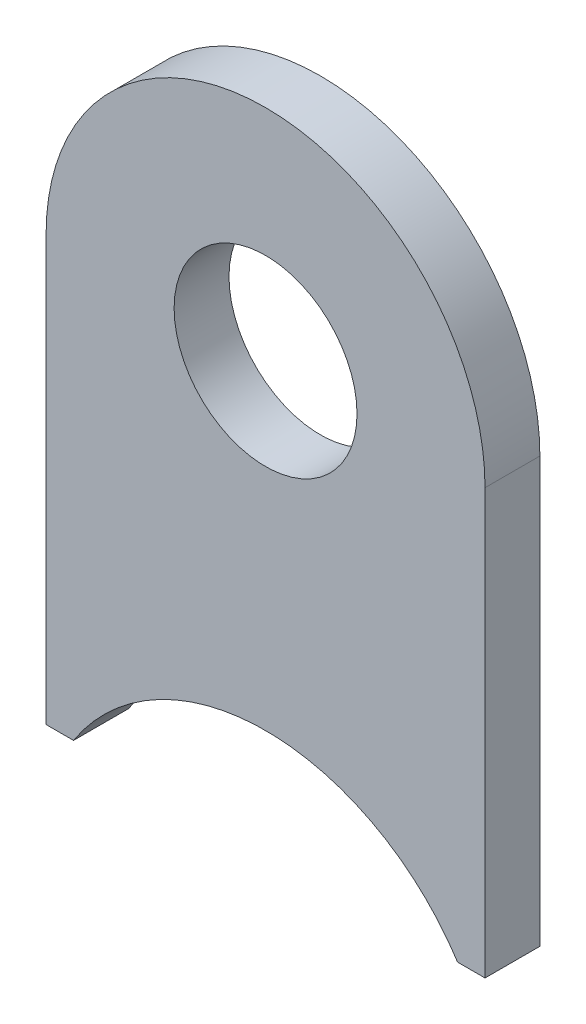
ISO-10303-21;
HEADER;
FILE_DESCRIPTION(('STEP AP214'),'2;1');
FILE_NAME('part.step','',(''),(''),'','','');
FILE_SCHEMA(('AUTOMOTIVE_DESIGN { 1 0 10303 214 1 1 1 1 }'));
ENDSEC;
DATA;
#1=APPLICATION_CONTEXT('core data for automotive mechanical design processes');
#2=APPLICATION_PROTOCOL_DEFINITION('international standard','automotive_design',2000,#1);
#3=PRODUCT_CONTEXT('',#1,'mechanical');
#4=PRODUCT('Part','Part','',(#3));
#5=PRODUCT_RELATED_PRODUCT_CATEGORY('part','',(#4));
#6=PRODUCT_DEFINITION_FORMATION('','',#4);
#7=PRODUCT_DEFINITION_CONTEXT('part definition',#1,'design');
#8=PRODUCT_DEFINITION('design','',#6,#7);
#9=PRODUCT_DEFINITION_SHAPE('','',#8);
#10=(LENGTH_UNIT() NAMED_UNIT(*) SI_UNIT(.MILLI.,.METRE.));
#11=(NAMED_UNIT(*) PLANE_ANGLE_UNIT() SI_UNIT($,.RADIAN.));
#12=(NAMED_UNIT(*) SI_UNIT($,.STERADIAN.) SOLID_ANGLE_UNIT());
#13=UNCERTAINTY_MEASURE_WITH_UNIT(LENGTH_MEASURE(1.E-05),#10,'distance_accuracy_value','');
#14=(GEOMETRIC_REPRESENTATION_CONTEXT(3) GLOBAL_UNCERTAINTY_ASSIGNED_CONTEXT((#13)) GLOBAL_UNIT_ASSIGNED_CONTEXT((#10,
#11,#12)) REPRESENTATION_CONTEXT('',''));
#15=CARTESIAN_POINT('',(0.,0.,0.));
#16=DIRECTION('',(0.,0.,1.));
#17=DIRECTION('',(1.,0.,0.));
#18=AXIS2_PLACEMENT_3D('',#15,#16,#17);
#19=CARTESIAN_POINT('',(0.,0.,1.5));
#20=DIRECTION('',(0.,0.,-1.));
#21=DIRECTION('',(-1.,0.,0.));
#22=AXIS2_PLACEMENT_3D('',#19,#20,#21);
#23=CYLINDRICAL_SURFACE('',#22,12.);
#24=CARTESIAN_POINT('',(0.,0.,-1.5));
#25=DIRECTION('',(0.,0.,-1.));
#26=DIRECTION('',(-1.,0.,0.));
#27=AXIS2_PLACEMENT_3D('',#24,#25,#26);
#28=CIRCLE('',#27,12.);
#29=CARTESIAN_POINT('',(-12.,0.,-1.5));
#30=VERTEX_POINT('',#29);
#31=CARTESIAN_POINT('',(12.,0.,-1.5));
#32=VERTEX_POINT('',#31);
#33=EDGE_CURVE('E119',#30,#32,#28,.T.);
#34=ORIENTED_EDGE('',*,*,#33,.F.);
#35=DIRECTION('',(0.,0.,-1.));
#36=VECTOR('',#35,1.);
#37=CARTESIAN_POINT('',(-12.,0.,1.5));
#38=LINE('',#37,#36);
#39=CARTESIAN_POINT('',(-12.,0.,1.5));
#40=VERTEX_POINT('',#39);
#41=EDGE_CURVE('E11',#40,#30,#38,.T.);
#42=ORIENTED_EDGE('',*,*,#41,.F.);
#43=CARTESIAN_POINT('',(0.,0.,1.5));
#44=DIRECTION('',(0.,0.,-1.));
#45=DIRECTION('',(-1.,0.,0.));
#46=AXIS2_PLACEMENT_3D('',#43,#44,#45);
#47=CIRCLE('',#46,12.);
#48=CARTESIAN_POINT('',(12.,0.,1.5));
#49=VERTEX_POINT('',#48);
#50=EDGE_CURVE('E134',#40,#49,#47,.T.);
#51=ORIENTED_EDGE('',*,*,#50,.T.);
#52=DIRECTION('',(0.,0.,-1.));
#53=VECTOR('',#52,1.);
#54=CARTESIAN_POINT('',(12.,0.,1.5));
#55=LINE('',#54,#53);
#56=EDGE_CURVE('E37',#49,#32,#55,.T.);
#57=ORIENTED_EDGE('',*,*,#56,.T.);
#58=EDGE_LOOP('',(#34,#42,#51,#57));
#59=FACE_BOUND('',#58,.T.);
#60=ADVANCED_FACE('F34',(#59),#23,.T.);
#61=CARTESIAN_POINT('',(-12.,-23.2176700168747,1.5));
#62=DIRECTION('',(-1.,0.,0.));
#63=DIRECTION('',(0.,-1.,0.));
#64=AXIS2_PLACEMENT_3D('',#61,#62,#63);
#65=PLANE('',#64);
#66=DIRECTION('',(0.,1.,0.));
#67=VECTOR('',#66,1.);
#68=CARTESIAN_POINT('',(-12.,-23.2176700168747,-1.5));
#69=LINE('',#68,#67);
#70=CARTESIAN_POINT('',(-12.,-23.2176700168747,-1.5));
#71=VERTEX_POINT('',#70);
#72=EDGE_CURVE('E132',#71,#30,#69,.T.);
#73=ORIENTED_EDGE('',*,*,#72,.F.);
#74=DIRECTION('',(0.,0.,-1.));
#75=VECTOR('',#74,1.);
#76=CARTESIAN_POINT('',(-12.,-23.2176700168747,1.5));
#77=LINE('',#76,#75);
#78=CARTESIAN_POINT('',(-12.,-23.2176700168747,1.5));
#79=VERTEX_POINT('',#78);
#80=EDGE_CURVE('E43',#79,#71,#77,.T.);
#81=ORIENTED_EDGE('',*,*,#80,.F.);
#82=DIRECTION('',(0.,1.,0.));
#83=VECTOR('',#82,1.);
#84=CARTESIAN_POINT('',(-12.,-23.2176700168747,1.5));
#85=LINE('',#84,#83);
#86=EDGE_CURVE('E109',#79,#40,#85,.T.);
#87=ORIENTED_EDGE('',*,*,#86,.T.);
#88=ORIENTED_EDGE('',*,*,#41,.T.);
#89=EDGE_LOOP('',(#73,#81,#87,#88));
#90=FACE_BOUND('',#89,.T.);
#91=ADVANCED_FACE('F142',(#90),#65,.T.);
#92=CARTESIAN_POINT('',(-10.5,-23.2176700168747,1.5));
#93=DIRECTION('',(0.,-1.,0.));
#94=DIRECTION('',(0.,0.,-1.));
#95=AXIS2_PLACEMENT_3D('',#92,#93,#94);
#96=PLANE('',#95);
#97=DIRECTION('',(-1.,0.,0.));
#98=VECTOR('',#97,1.);
#99=CARTESIAN_POINT('',(-10.5,-23.2176700168747,-1.5));
#100=LINE('',#99,#98);
#101=CARTESIAN_POINT('',(-10.5,-23.2176700168747,-1.5));
#102=VERTEX_POINT('',#101);
#103=EDGE_CURVE('E96',#102,#71,#100,.T.);
#104=ORIENTED_EDGE('',*,*,#103,.F.);
#105=DIRECTION('',(0.,0.,-1.));
#106=VECTOR('',#105,1.);
#107=CARTESIAN_POINT('',(-10.5,-23.2176700168747,1.5));
#108=LINE('',#107,#106);
#109=CARTESIAN_POINT('',(-10.5,-23.2176700168747,1.5));
#110=VERTEX_POINT('',#109);
#111=EDGE_CURVE('E91',#110,#102,#108,.T.);
#112=ORIENTED_EDGE('',*,*,#111,.F.);
#113=DIRECTION('',(-1.,0.,0.));
#114=VECTOR('',#113,1.);
#115=CARTESIAN_POINT('',(-10.5,-23.2176700168747,1.5));
#116=LINE('',#115,#114);
#117=EDGE_CURVE('E94',#110,#79,#116,.T.);
#118=ORIENTED_EDGE('',*,*,#117,.T.);
#119=ORIENTED_EDGE('',*,*,#80,.T.);
#120=EDGE_LOOP('',(#104,#112,#118,#119));
#121=FACE_BOUND('',#120,.T.);
#122=ADVANCED_FACE('F93',(#121),#96,.T.);
#123=CARTESIAN_POINT('',(0.,-30.,1.5));
#124=DIRECTION('',(0.,0.,-1.));
#125=DIRECTION('',(-1.,0.,0.));
#126=AXIS2_PLACEMENT_3D('',#123,#124,#125);
#127=CYLINDRICAL_SURFACE('',#126,12.5);
#128=CARTESIAN_POINT('',(0.,-30.,-1.5));
#129=DIRECTION('',(0.,0.,1.));
#130=DIRECTION('',(1.,0.,0.));
#131=AXIS2_PLACEMENT_3D('',#128,#129,#130);
#132=CIRCLE('',#131,12.5);
#133=CARTESIAN_POINT('',(10.5,-23.2176700168747,-1.5));
#134=VERTEX_POINT('',#133);
#135=EDGE_CURVE('E129',#134,#102,#132,.T.);
#136=ORIENTED_EDGE('',*,*,#135,.F.);
#137=DIRECTION('',(0.,0.,-1.));
#138=VECTOR('',#137,1.);
#139=CARTESIAN_POINT('',(10.5,-23.2176700168747,1.5));
#140=LINE('',#139,#138);
#141=CARTESIAN_POINT('',(10.5,-23.2176700168747,1.5));
#142=VERTEX_POINT('',#141);
#143=EDGE_CURVE('E101',#142,#134,#140,.T.);
#144=ORIENTED_EDGE('',*,*,#143,.F.);
#145=CARTESIAN_POINT('',(0.,-30.,1.5));
#146=DIRECTION('',(0.,0.,1.));
#147=DIRECTION('',(1.,0.,0.));
#148=AXIS2_PLACEMENT_3D('',#145,#146,#147);
#149=CIRCLE('',#148,12.5);
#150=EDGE_CURVE('E107',#142,#110,#149,.T.);
#151=ORIENTED_EDGE('',*,*,#150,.T.);
#152=ORIENTED_EDGE('',*,*,#111,.T.);
#153=EDGE_LOOP('',(#136,#144,#151,#152));
#154=FACE_BOUND('',#153,.T.);
#155=ADVANCED_FACE('F111',(#154),#127,.F.);
#156=CARTESIAN_POINT('',(12.,-23.2176700168747,1.5));
#157=DIRECTION('',(0.,-1.,0.));
#158=DIRECTION('',(0.,0.,-1.));
#159=AXIS2_PLACEMENT_3D('',#156,#157,#158);
#160=PLANE('',#159);
#161=DIRECTION('',(-1.,0.,0.));
#162=VECTOR('',#161,1.);
#163=CARTESIAN_POINT('',(12.,-23.2176700168747,-1.5));
#164=LINE('',#163,#162);
#165=CARTESIAN_POINT('',(12.,-23.2176700168747,-1.5));
#166=VERTEX_POINT('',#165);
#167=EDGE_CURVE('E126',#166,#134,#164,.T.);
#168=ORIENTED_EDGE('',*,*,#167,.F.);
#169=DIRECTION('',(0.,0.,-1.));
#170=VECTOR('',#169,1.);
#171=CARTESIAN_POINT('',(12.,-23.2176700168747,1.5));
#172=LINE('',#171,#170);
#173=CARTESIAN_POINT('',(12.,-23.2176700168747,1.5));
#174=VERTEX_POINT('',#173);
#175=EDGE_CURVE('E137',#174,#166,#172,.T.);
#176=ORIENTED_EDGE('',*,*,#175,.F.);
#177=DIRECTION('',(-1.,0.,0.));
#178=VECTOR('',#177,1.);
#179=CARTESIAN_POINT('',(12.,-23.2176700168747,1.5));
#180=LINE('',#179,#178);
#181=EDGE_CURVE('E112',#174,#142,#180,.T.);
#182=ORIENTED_EDGE('',*,*,#181,.T.);
#183=ORIENTED_EDGE('',*,*,#143,.T.);
#184=EDGE_LOOP('',(#168,#176,#182,#183));
#185=FACE_BOUND('',#184,.T.);
#186=ADVANCED_FACE('F155',(#185),#160,.T.);
#187=CARTESIAN_POINT('',(12.,0.,1.5));
#188=DIRECTION('',(1.,0.,0.));
#189=DIRECTION('',(0.,1.,0.));
#190=AXIS2_PLACEMENT_3D('',#187,#188,#189);
#191=PLANE('',#190);
#192=DIRECTION('',(0.,-1.,0.));
#193=VECTOR('',#192,1.);
#194=CARTESIAN_POINT('',(12.,0.,-1.5));
#195=LINE('',#194,#193);
#196=EDGE_CURVE('E122',#32,#166,#195,.T.);
#197=ORIENTED_EDGE('',*,*,#196,.F.);
#198=ORIENTED_EDGE('',*,*,#56,.F.);
#199=DIRECTION('',(0.,-1.,0.));
#200=VECTOR('',#199,1.);
#201=CARTESIAN_POINT('',(12.,0.,1.5));
#202=LINE('',#201,#200);
#203=EDGE_CURVE('E114',#49,#174,#202,.T.);
#204=ORIENTED_EDGE('',*,*,#203,.T.);
#205=ORIENTED_EDGE('',*,*,#175,.T.);
#206=EDGE_LOOP('',(#197,#198,#204,#205));
#207=FACE_BOUND('',#206,.T.);
#208=ADVANCED_FACE('F139',(#207),#191,.T.);
#209=CARTESIAN_POINT('',(0.,0.,1.5));
#210=DIRECTION('',(0.,0.,-1.));
#211=DIRECTION('',(-1.,0.,0.));
#212=AXIS2_PLACEMENT_3D('',#209,#210,#211);
#213=PLANE('',#212);
#214=CARTESIAN_POINT('',(0.,0.,1.5));
#215=DIRECTION('',(0.,0.,-1.));
#216=DIRECTION('',(1.,0.,0.));
#217=AXIS2_PLACEMENT_3D('',#214,#215,#216);
#218=CIRCLE('',#217,5.);
#219=CARTESIAN_POINT('',(5.,0.,1.5));
#220=VERTEX_POINT('',#219);
#221=EDGE_CURVE('E123',#220,#220,#218,.T.);
#222=ORIENTED_EDGE('',*,*,#221,.T.);
#223=EDGE_LOOP('',(#222));
#224=FACE_BOUND('',#223,.T.);
#225=ORIENTED_EDGE('',*,*,#50,.F.);
#226=ORIENTED_EDGE('',*,*,#86,.F.);
#227=ORIENTED_EDGE('',*,*,#117,.F.);
#228=ORIENTED_EDGE('',*,*,#150,.F.);
#229=ORIENTED_EDGE('',*,*,#181,.F.);
#230=ORIENTED_EDGE('',*,*,#203,.F.);
#231=EDGE_LOOP('',(#225,#226,#227,#228,#229,#230));
#232=FACE_BOUND('',#231,.T.);
#233=ADVANCED_FACE('F105',(#224,#232),#213,.F.);
#234=CARTESIAN_POINT('',(0.,0.,-1.5));
#235=DIRECTION('',(0.,0.,-1.));
#236=DIRECTION('',(-1.,0.,0.));
#237=AXIS2_PLACEMENT_3D('',#234,#235,#236);
#238=PLANE('',#237);
#239=CARTESIAN_POINT('',(0.,0.,-1.5));
#240=DIRECTION('',(0.,0.,-1.));
#241=DIRECTION('',(1.,0.,0.));
#242=AXIS2_PLACEMENT_3D('',#239,#240,#241);
#243=CIRCLE('',#242,5.);
#244=CARTESIAN_POINT('',(5.,0.,-1.5));
#245=VERTEX_POINT('',#244);
#246=EDGE_CURVE('E178',#245,#245,#243,.T.);
#247=ORIENTED_EDGE('',*,*,#246,.F.);
#248=EDGE_LOOP('',(#247));
#249=FACE_BOUND('',#248,.T.);
#250=ORIENTED_EDGE('',*,*,#33,.T.);
#251=ORIENTED_EDGE('',*,*,#196,.T.);
#252=ORIENTED_EDGE('',*,*,#167,.T.);
#253=ORIENTED_EDGE('',*,*,#135,.T.);
#254=ORIENTED_EDGE('',*,*,#103,.T.);
#255=ORIENTED_EDGE('',*,*,#72,.T.);
#256=EDGE_LOOP('',(#250,#251,#252,#253,#254,#255));
#257=FACE_BOUND('',#256,.T.);
#258=ADVANCED_FACE('F141',(#249,#257),#238,.T.);
#259=CARTESIAN_POINT('',(0.,0.,1.5));
#260=DIRECTION('',(0.,0.,-1.));
#261=DIRECTION('',(-1.,0.,0.));
#262=AXIS2_PLACEMENT_3D('',#259,#260,#261);
#263=CYLINDRICAL_SURFACE('',#262,5.);
#264=ORIENTED_EDGE('',*,*,#221,.F.);
#265=EDGE_LOOP('',(#264));
#266=FACE_BOUND('',#265,.T.);
#267=ORIENTED_EDGE('',*,*,#246,.T.);
#268=EDGE_LOOP('',(#267));
#269=FACE_BOUND('',#268,.T.);
#270=ADVANCED_FACE('F166',(#266,#269),#263,.F.);
#271=CLOSED_SHELL('',(#60,#91,#122,#155,#186,#208,#233,#258,#270));
#272=MANIFOLD_SOLID_BREP('B2',#271);
#273=ADVANCED_BREP_SHAPE_REPRESENTATION('',(#18,#272),#14);
#274=SHAPE_DEFINITION_REPRESENTATION(#9,#273);
ENDSEC;
END-ISO-10303-21;
